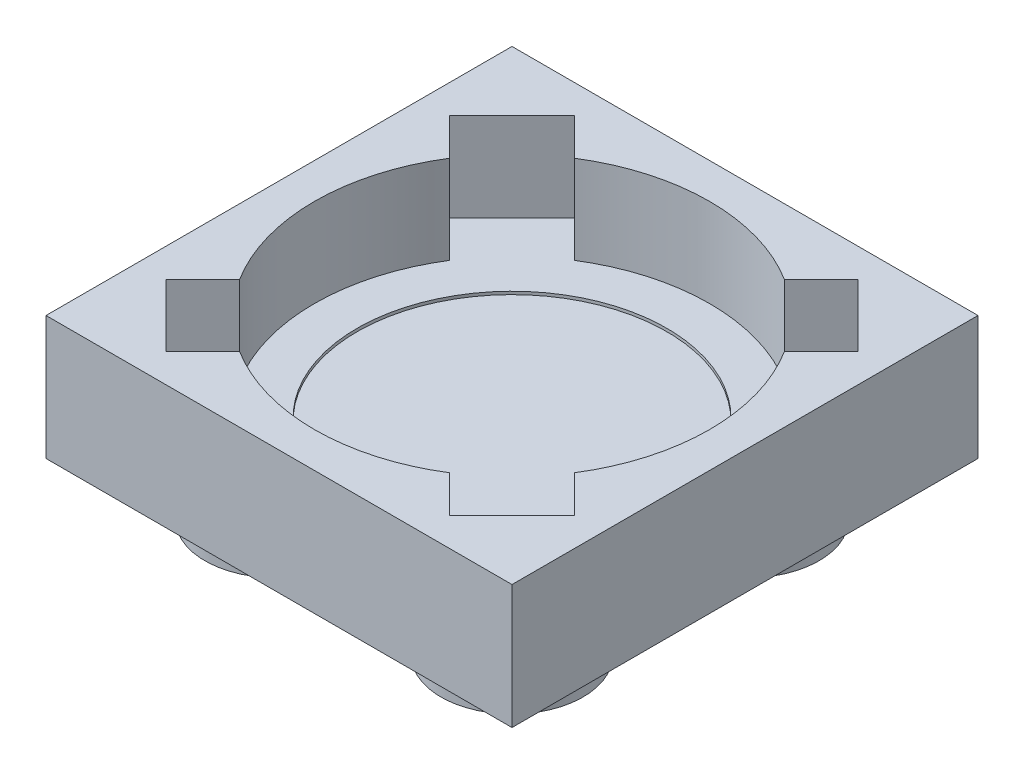
ISO-10303-21;
HEADER;
FILE_DESCRIPTION(('STEP AP214'),'2;1');
FILE_NAME('part.step','',(''),(''),'','','');
FILE_SCHEMA(('AUTOMOTIVE_DESIGN { 1 0 10303 214 1 1 1 1 }'));
ENDSEC;
DATA;
#1=APPLICATION_CONTEXT('core data for automotive mechanical design processes');
#2=APPLICATION_PROTOCOL_DEFINITION('international standard','automotive_design',2000,#1);
#3=PRODUCT_CONTEXT('',#1,'mechanical');
#4=PRODUCT('Part','Part','',(#3));
#5=PRODUCT_RELATED_PRODUCT_CATEGORY('part','',(#4));
#6=PRODUCT_DEFINITION_FORMATION('','',#4);
#7=PRODUCT_DEFINITION_CONTEXT('part definition',#1,'design');
#8=PRODUCT_DEFINITION('design','',#6,#7);
#9=PRODUCT_DEFINITION_SHAPE('','',#8);
#10=(LENGTH_UNIT() NAMED_UNIT(*) SI_UNIT(.MILLI.,.METRE.));
#11=(NAMED_UNIT(*) PLANE_ANGLE_UNIT() SI_UNIT($,.RADIAN.));
#12=(NAMED_UNIT(*) SI_UNIT($,.STERADIAN.) SOLID_ANGLE_UNIT());
#13=UNCERTAINTY_MEASURE_WITH_UNIT(LENGTH_MEASURE(1.E-05),#10,'distance_accuracy_value','');
#14=(GEOMETRIC_REPRESENTATION_CONTEXT(3) GLOBAL_UNCERTAINTY_ASSIGNED_CONTEXT((#13)) GLOBAL_UNIT_ASSIGNED_CONTEXT((#10,
#11,#12)) REPRESENTATION_CONTEXT('',''));
#15=CARTESIAN_POINT('',(0.,0.,0.));
#16=DIRECTION('',(0.,0.,1.));
#17=DIRECTION('',(1.,0.,0.));
#18=AXIS2_PLACEMENT_3D('',#15,#16,#17);
#19=CARTESIAN_POINT('',(7.9,9.47523086789974,-7.9));
#20=DIRECTION('',(0.,-1.,0.));
#21=DIRECTION('',(0.,0.,-1.));
#22=AXIS2_PLACEMENT_3D('',#19,#20,#21);
#23=CYLINDRICAL_SURFACE('',#22,6.7);
#24=CARTESIAN_POINT('',(7.9,-3.,-7.9));
#25=DIRECTION('',(0.,1.,0.));
#26=DIRECTION('',(0.,0.,1.));
#27=AXIS2_PLACEMENT_3D('',#24,#25,#26);
#28=CIRCLE('',#27,6.7);
#29=CARTESIAN_POINT('',(11.4566983804663,-3.,-13.5780187240259));
#30=VERTEX_POINT('',#29);
#31=CARTESIAN_POINT('',(4.34330161953374,-3.,-13.5780187240259));
#32=VERTEX_POINT('',#31);
#33=EDGE_CURVE('E277',#30,#32,#28,.T.);
#34=ORIENTED_EDGE('',*,*,#33,.F.);
#35=DIRECTION('',(0.,-1.,0.));
#36=VECTOR('',#35,1.);
#37=CARTESIAN_POINT('',(11.4566983804663,9.47523086789974,-13.5780187240259));
#38=LINE('',#37,#36);
#39=CARTESIAN_POINT('',(11.4566983804663,0.,-13.5780187240259));
#40=VERTEX_POINT('',#39);
#41=EDGE_CURVE('E81',#30,#40,#38,.F.);
#42=ORIENTED_EDGE('',*,*,#41,.T.);
#43=CARTESIAN_POINT('',(7.9,0.,-7.9));
#44=DIRECTION('',(0.,-1.,0.));
#45=DIRECTION('',(0.,0.,-1.));
#46=AXIS2_PLACEMENT_3D('',#43,#44,#45);
#47=CIRCLE('',#46,6.7);
#48=CARTESIAN_POINT('',(4.34330161953374,0.,-13.5780187240259));
#49=VERTEX_POINT('',#48);
#50=EDGE_CURVE('E296',#49,#40,#47,.T.);
#51=ORIENTED_EDGE('',*,*,#50,.F.);
#52=DIRECTION('',(0.,-1.,0.));
#53=VECTOR('',#52,1.);
#54=CARTESIAN_POINT('',(4.34330161953374,9.47523086789974,-13.5780187240259));
#55=LINE('',#54,#53);
#56=EDGE_CURVE('E370',#32,#49,#55,.F.);
#57=ORIENTED_EDGE('',*,*,#56,.F.);
#58=EDGE_LOOP('',(#34,#42,#51,#57));
#59=FACE_BOUND('',#58,.T.);
#60=ADVANCED_FACE('F73',(#59),#23,.F.);
#61=DIRECTION('',(0.,-1.,0.));
#62=VECTOR('',#61,1.);
#63=CARTESIAN_POINT('',(13.5780187240259,9.47523086789974,-11.4566983804662));
#64=LINE('',#63,#62);
#65=CARTESIAN_POINT('',(13.5780187240259,-3.,-11.4566983804662));
#66=VERTEX_POINT('',#65);
#67=CARTESIAN_POINT('',(13.5780187240259,0.,-11.4566983804662));
#68=VERTEX_POINT('',#67);
#69=EDGE_CURVE('E13',#66,#68,#64,.F.);
#70=ORIENTED_EDGE('',*,*,#69,.F.);
#71=CARTESIAN_POINT('',(13.5780187240259,-3.,-4.34330161953374));
#72=VERTEX_POINT('',#71);
#73=EDGE_CURVE('E216',#72,#66,#28,.T.);
#74=ORIENTED_EDGE('',*,*,#73,.F.);
#75=DIRECTION('',(0.,-1.,0.));
#76=VECTOR('',#75,1.);
#77=CARTESIAN_POINT('',(13.5780187240259,9.47523086789974,-4.34330161953374));
#78=LINE('',#77,#76);
#79=CARTESIAN_POINT('',(13.5780187240259,0.,-4.34330161953374));
#80=VERTEX_POINT('',#79);
#81=EDGE_CURVE('E376',#72,#80,#78,.F.);
#82=ORIENTED_EDGE('',*,*,#81,.T.);
#83=EDGE_CURVE('E300',#68,#80,#47,.T.);
#84=ORIENTED_EDGE('',*,*,#83,.F.);
#85=EDGE_LOOP('',(#70,#74,#82,#84));
#86=FACE_BOUND('',#85,.T.);
#87=ADVANCED_FACE('F422',(#86),#23,.F.);
#88=DIRECTION('',(0.,-1.,0.));
#89=VECTOR('',#88,1.);
#90=CARTESIAN_POINT('',(11.4566983804663,9.47523086789974,-2.2219812759741));
#91=LINE('',#90,#89);
#92=CARTESIAN_POINT('',(11.4566983804663,-3.,-2.2219812759741));
#93=VERTEX_POINT('',#92);
#94=CARTESIAN_POINT('',(11.4566983804663,0.,-2.2219812759741));
#95=VERTEX_POINT('',#94);
#96=EDGE_CURVE('E378',#93,#95,#91,.F.);
#97=ORIENTED_EDGE('',*,*,#96,.F.);
#98=CARTESIAN_POINT('',(4.34330161953369,-3.,-2.22198127597414));
#99=VERTEX_POINT('',#98);
#100=EDGE_CURVE('E305',#99,#93,#28,.T.);
#101=ORIENTED_EDGE('',*,*,#100,.F.);
#102=DIRECTION('',(0.,-1.,0.));
#103=VECTOR('',#102,1.);
#104=CARTESIAN_POINT('',(4.34330161953369,9.47523086789974,-2.22198127597414));
#105=LINE('',#104,#103);
#106=CARTESIAN_POINT('',(4.34330161953368,0.,-2.22198127597414));
#107=VERTEX_POINT('',#106);
#108=EDGE_CURVE('E372',#99,#107,#105,.F.);
#109=ORIENTED_EDGE('',*,*,#108,.T.);
#110=EDGE_CURVE('E411',#95,#107,#47,.T.);
#111=ORIENTED_EDGE('',*,*,#110,.F.);
#112=EDGE_LOOP('',(#97,#101,#109,#111));
#113=FACE_BOUND('',#112,.T.);
#114=ADVANCED_FACE('F408',(#113),#23,.F.);
#115=CARTESIAN_POINT('',(0.,-3.,0.));
#116=DIRECTION('',(0.,-1.,0.));
#117=DIRECTION('',(0.,0.,-1.));
#118=AXIS2_PLACEMENT_3D('',#115,#116,#117);
#119=PLANE('',#118);
#120=CARTESIAN_POINT('',(7.9,-3.,-7.9));
#121=DIRECTION('',(0.,1.,0.));
#122=DIRECTION('',(0.,0.,1.));
#123=AXIS2_PLACEMENT_3D('',#120,#121,#122);
#124=CIRCLE('',#123,5.25);
#125=CARTESIAN_POINT('',(7.9,-3.,-2.65));
#126=VERTEX_POINT('',#125);
#127=EDGE_CURVE('E299',#126,#126,#124,.T.);
#128=ORIENTED_EDGE('',*,*,#127,.F.);
#129=EDGE_LOOP('',(#128));
#130=FACE_BOUND('',#129,.T.);
#131=ORIENTED_EDGE('',*,*,#73,.T.);
#132=DIRECTION('',(0.70710678118655,0.,-0.707106781186545));
#133=VECTOR('',#132,1.);
#134=CARTESIAN_POINT('',(8.96066017177982,-3.,-6.83933982822018));
#135=LINE('',#134,#133);
#136=CARTESIAN_POINT('',(14.8296464556282,-3.,-12.7083261120685));
#137=VERTEX_POINT('',#136);
#138=EDGE_CURVE('E209',#66,#137,#135,.T.);
#139=ORIENTED_EDGE('',*,*,#138,.T.);
#140=DIRECTION('',(0.707106781186545,0.,0.70710678118655));
#141=VECTOR('',#140,1.);
#142=CARTESIAN_POINT('',(5.86898628384839,-3.,-21.6689862838484));
#143=LINE('',#142,#141);
#144=CARTESIAN_POINT('',(12.7083261120685,-3.,-14.8296464556281));
#145=VERTEX_POINT('',#144);
#146=EDGE_CURVE('E213',#145,#137,#143,.T.);
#147=ORIENTED_EDGE('',*,*,#146,.F.);
#148=DIRECTION('',(0.707106781186549,0.,-0.707106781186546));
#149=VECTOR('',#148,1.);
#150=CARTESIAN_POINT('',(6.8393398282202,-3.,-8.96066017177983));
#151=LINE('',#150,#149);
#152=EDGE_CURVE('E230',#30,#145,#151,.T.);
#153=ORIENTED_EDGE('',*,*,#152,.F.);
#154=ORIENTED_EDGE('',*,*,#33,.T.);
#155=DIRECTION('',(-0.707106781186548,0.,-0.707106781186547));
#156=VECTOR('',#155,1.);
#157=CARTESIAN_POINT('',(8.96066017177982,-3.,-8.96066017177983));
#158=LINE('',#157,#156);
#159=CARTESIAN_POINT('',(3.09167388793148,-3.,-14.8296464556282));
#160=VERTEX_POINT('',#159);
#161=EDGE_CURVE('E284',#32,#160,#158,.T.);
#162=ORIENTED_EDGE('',*,*,#161,.T.);
#163=DIRECTION('',(0.707106781186547,0.,-0.707106781186548));
#164=VECTOR('',#163,1.);
#165=CARTESIAN_POINT('',(-5.86898628384834,-3.,-5.86898628384834));
#166=LINE('',#165,#164);
#167=CARTESIAN_POINT('',(0.970353544371835,-3.,-12.7083261120685));
#168=VERTEX_POINT('',#167);
#169=EDGE_CURVE('E285',#168,#160,#166,.T.);
#170=ORIENTED_EDGE('',*,*,#169,.F.);
#171=DIRECTION('',(-0.707106781186549,0.,-0.707106781186546));
#172=VECTOR('',#171,1.);
#173=CARTESIAN_POINT('',(6.83933982822018,-3.,-6.8393398282202));
#174=LINE('',#173,#172);
#175=CARTESIAN_POINT('',(2.2219812759741,-3.,-11.4566983804663));
#176=VERTEX_POINT('',#175);
#177=EDGE_CURVE('E288',#176,#168,#174,.T.);
#178=ORIENTED_EDGE('',*,*,#177,.F.);
#179=CARTESIAN_POINT('',(2.22198127597406,-3.,-4.3433016195338));
#180=VERTEX_POINT('',#179);
#181=EDGE_CURVE('E302',#176,#180,#28,.T.);
#182=ORIENTED_EDGE('',*,*,#181,.T.);
#183=DIRECTION('',(-0.707106781186555,0.,0.70710678118654));
#184=VECTOR('',#183,1.);
#185=CARTESIAN_POINT('',(6.83933982822018,-3.,-8.96066017177983));
#186=LINE('',#185,#184);
#187=CARTESIAN_POINT('',(0.970353544371786,-3.,-3.09167388793155));
#188=VERTEX_POINT('',#187);
#189=EDGE_CURVE('E263',#180,#188,#186,.T.);
#190=ORIENTED_EDGE('',*,*,#189,.T.);
#191=DIRECTION('',(-0.70710678118654,0.,-0.707106781186555));
#192=VECTOR('',#191,1.);
#193=CARTESIAN_POINT('',(9.93101371615151,-3.,5.86898628384837));
#194=LINE('',#193,#192);
#195=CARTESIAN_POINT('',(3.0916738879314,-3.,-0.970353544371883));
#196=VERTEX_POINT('',#195);
#197=EDGE_CURVE('E264',#196,#188,#194,.T.);
#198=ORIENTED_EDGE('',*,*,#197,.F.);
#199=DIRECTION('',(-0.707106781186554,0.,0.707106781186541));
#200=VECTOR('',#199,1.);
#201=CARTESIAN_POINT('',(8.96066017177979,-3.,-6.83933982822017));
#202=LINE('',#201,#200);
#203=EDGE_CURVE('E267',#99,#196,#202,.T.);
#204=ORIENTED_EDGE('',*,*,#203,.F.);
#205=ORIENTED_EDGE('',*,*,#100,.T.);
#206=DIRECTION('',(0.707106781186548,0.,0.707106781186547));
#207=VECTOR('',#206,1.);
#208=CARTESIAN_POINT('',(6.83933982822018,-3.,-6.83933982822017));
#209=LINE('',#208,#207);
#210=CARTESIAN_POINT('',(12.7083261120685,-3.,-0.970353544371836));
#211=VERTEX_POINT('',#210);
#212=EDGE_CURVE('E245',#93,#211,#209,.T.);
#213=ORIENTED_EDGE('',*,*,#212,.T.);
#214=DIRECTION('',(-0.707106781186547,0.,0.707106781186548));
#215=VECTOR('',#214,1.);
#216=CARTESIAN_POINT('',(21.6689862838483,-3.,-9.93101371615166));
#217=LINE('',#216,#215);
#218=CARTESIAN_POINT('',(14.8296464556282,-3.,-3.09167388793148));
#219=VERTEX_POINT('',#218);
#220=EDGE_CURVE('E246',#219,#211,#217,.T.);
#221=ORIENTED_EDGE('',*,*,#220,.F.);
#222=DIRECTION('',(0.707106781186549,0.,0.707106781186546));
#223=VECTOR('',#222,1.);
#224=CARTESIAN_POINT('',(8.96066017177982,-3.,-8.9606601717798));
#225=LINE('',#224,#223);
#226=EDGE_CURVE('E249',#72,#219,#225,.T.);
#227=ORIENTED_EDGE('',*,*,#226,.F.);
#228=EDGE_LOOP('',(#131,#139,#147,#153,#154,#162,#170,#178,#182,#190,#198,#204,#205,#213,#221,#227));
#229=FACE_BOUND('',#228,.T.);
#230=ADVANCED_FACE('F211',(#130,#229),#119,.F.);
#231=CARTESIAN_POINT('',(3.9,-6.,-3.9));
#232=DIRECTION('',(0.,-1.,0.));
#233=DIRECTION('',(0.,0.,-1.));
#234=AXIS2_PLACEMENT_3D('',#231,#232,#233);
#235=PLANE('',#234);
#236=CARTESIAN_POINT('',(3.9,-6.,-3.9));
#237=DIRECTION('',(0.,-1.,0.));
#238=DIRECTION('',(0.,0.,-1.));
#239=AXIS2_PLACEMENT_3D('',#236,#237,#238);
#240=CIRCLE('',#239,2.41);
#241=CARTESIAN_POINT('',(3.9,-6.,-6.31));
#242=VERTEX_POINT('',#241);
#243=EDGE_CURVE('E364',#242,#242,#240,.T.);
#244=ORIENTED_EDGE('',*,*,#243,.T.);
#245=EDGE_LOOP('',(#244));
#246=FACE_BOUND('',#245,.T.);
#247=ADVANCED_FACE('F75',(#246),#235,.T.);
#248=CARTESIAN_POINT('',(3.9,-6.,-3.9));
#249=DIRECTION('',(0.,1.,0.));
#250=DIRECTION('',(0.,0.,1.));
#251=AXIS2_PLACEMENT_3D('',#248,#249,#250);
#252=CYLINDRICAL_SURFACE('',#251,2.41);
#253=ORIENTED_EDGE('',*,*,#243,.F.);
#254=EDGE_LOOP('',(#253));
#255=FACE_BOUND('',#254,.T.);
#256=CARTESIAN_POINT('',(3.9,-4.2,-3.9));
#257=DIRECTION('',(0.,-1.,0.));
#258=DIRECTION('',(0.,0.,-1.));
#259=AXIS2_PLACEMENT_3D('',#256,#257,#258);
#260=CIRCLE('',#259,2.41);
#261=CARTESIAN_POINT('',(3.9,-4.2,-6.31));
#262=VERTEX_POINT('',#261);
#263=EDGE_CURVE('E361',#262,#262,#260,.T.);
#264=ORIENTED_EDGE('',*,*,#263,.T.);
#265=EDGE_LOOP('',(#264));
#266=FACE_BOUND('',#265,.T.);
#267=ADVANCED_FACE('F462',(#255,#266),#252,.T.);
#268=CARTESIAN_POINT('',(3.9,-6.,-11.9));
#269=DIRECTION('',(0.,-1.,0.));
#270=DIRECTION('',(0.,0.,-1.));
#271=AXIS2_PLACEMENT_3D('',#268,#269,#270);
#272=PLANE('',#271);
#273=CARTESIAN_POINT('',(3.9,-6.,-11.9));
#274=DIRECTION('',(0.,-1.,0.));
#275=DIRECTION('',(0.,0.,-1.));
#276=AXIS2_PLACEMENT_3D('',#273,#274,#275);
#277=CIRCLE('',#276,2.41);
#278=CARTESIAN_POINT('',(3.9,-6.,-14.31));
#279=VERTEX_POINT('',#278);
#280=EDGE_CURVE('E358',#279,#279,#277,.T.);
#281=ORIENTED_EDGE('',*,*,#280,.T.);
#282=EDGE_LOOP('',(#281));
#283=FACE_BOUND('',#282,.T.);
#284=ADVANCED_FACE('F494',(#283),#272,.T.);
#285=CARTESIAN_POINT('',(3.9,-6.,-11.9));
#286=DIRECTION('',(0.,1.,0.));
#287=DIRECTION('',(0.,0.,1.));
#288=AXIS2_PLACEMENT_3D('',#285,#286,#287);
#289=CYLINDRICAL_SURFACE('',#288,2.41);
#290=ORIENTED_EDGE('',*,*,#280,.F.);
#291=EDGE_LOOP('',(#290));
#292=FACE_BOUND('',#291,.T.);
#293=CARTESIAN_POINT('',(3.9,-4.2,-11.9));
#294=DIRECTION('',(0.,-1.,0.));
#295=DIRECTION('',(0.,0.,-1.));
#296=AXIS2_PLACEMENT_3D('',#293,#294,#295);
#297=CIRCLE('',#296,2.41);
#298=CARTESIAN_POINT('',(3.9,-4.2,-14.31));
#299=VERTEX_POINT('',#298);
#300=EDGE_CURVE('E350',#299,#299,#297,.T.);
#301=ORIENTED_EDGE('',*,*,#300,.T.);
#302=EDGE_LOOP('',(#301));
#303=FACE_BOUND('',#302,.T.);
#304=ADVANCED_FACE('F490',(#292,#303),#289,.T.);
#305=CARTESIAN_POINT('',(0.,-4.2,0.));
#306=DIRECTION('',(-1.,0.,0.));
#307=DIRECTION('',(0.,0.,1.));
#308=AXIS2_PLACEMENT_3D('',#305,#306,#307);
#309=PLANE('',#308);
#310=DIRECTION('',(0.,0.,1.));
#311=VECTOR('',#310,1.);
#312=CARTESIAN_POINT('',(0.,0.,0.));
#313=LINE('',#312,#311);
#314=CARTESIAN_POINT('',(0.,0.,-15.8));
#315=VERTEX_POINT('',#314);
#316=CARTESIAN_POINT('',(0.,0.,0.));
#317=VERTEX_POINT('',#316);
#318=EDGE_CURVE('E321',#315,#317,#313,.T.);
#319=ORIENTED_EDGE('',*,*,#318,.F.);
#320=DIRECTION('',(0.,1.,0.));
#321=VECTOR('',#320,1.);
#322=CARTESIAN_POINT('',(0.,-4.2,-15.8));
#323=LINE('',#322,#321);
#324=CARTESIAN_POINT('',(0.,-4.2,-15.8));
#325=VERTEX_POINT('',#324);
#326=EDGE_CURVE('E348',#325,#315,#323,.T.);
#327=ORIENTED_EDGE('',*,*,#326,.F.);
#328=DIRECTION('',(0.,0.,1.));
#329=VECTOR('',#328,1.);
#330=CARTESIAN_POINT('',(0.,-4.2,0.));
#331=LINE('',#330,#329);
#332=CARTESIAN_POINT('',(0.,-4.2,0.));
#333=VERTEX_POINT('',#332);
#334=EDGE_CURVE('E324',#325,#333,#331,.T.);
#335=ORIENTED_EDGE('',*,*,#334,.T.);
#336=DIRECTION('',(0.,1.,0.));
#337=VECTOR('',#336,1.);
#338=CARTESIAN_POINT('',(0.,-4.2,0.));
#339=LINE('',#338,#337);
#340=EDGE_CURVE('E337',#333,#317,#339,.T.);
#341=ORIENTED_EDGE('',*,*,#340,.T.);
#342=EDGE_LOOP('',(#319,#327,#335,#341));
#343=FACE_BOUND('',#342,.T.);
#344=ADVANCED_FACE('F480',(#343),#309,.T.);
#345=CARTESIAN_POINT('',(0.,-4.2,-15.8));
#346=DIRECTION('',(0.,0.,-1.));
#347=DIRECTION('',(-1.,0.,0.));
#348=AXIS2_PLACEMENT_3D('',#345,#346,#347);
#349=PLANE('',#348);
#350=DIRECTION('',(-1.,0.,0.));
#351=VECTOR('',#350,1.);
#352=CARTESIAN_POINT('',(0.,0.,-15.8));
#353=LINE('',#352,#351);
#354=CARTESIAN_POINT('',(15.8,0.,-15.8));
#355=VERTEX_POINT('',#354);
#356=EDGE_CURVE('E328',#355,#315,#353,.T.);
#357=ORIENTED_EDGE('',*,*,#356,.F.);
#358=DIRECTION('',(0.,1.,0.));
#359=VECTOR('',#358,1.);
#360=CARTESIAN_POINT('',(15.8,-4.2,-15.8));
#361=LINE('',#360,#359);
#362=CARTESIAN_POINT('',(15.8,-4.2,-15.8));
#363=VERTEX_POINT('',#362);
#364=EDGE_CURVE('E351',#363,#355,#361,.T.);
#365=ORIENTED_EDGE('',*,*,#364,.F.);
#366=DIRECTION('',(-1.,0.,0.));
#367=VECTOR('',#366,1.);
#368=CARTESIAN_POINT('',(0.,-4.2,-15.8));
#369=LINE('',#368,#367);
#370=EDGE_CURVE('E334',#363,#325,#369,.T.);
#371=ORIENTED_EDGE('',*,*,#370,.T.);
#372=ORIENTED_EDGE('',*,*,#326,.T.);
#373=EDGE_LOOP('',(#357,#365,#371,#372));
#374=FACE_BOUND('',#373,.T.);
#375=ADVANCED_FACE('F476',(#374),#349,.T.);
#376=CARTESIAN_POINT('',(15.8,-4.2,0.));
#377=DIRECTION('',(1.,0.,0.));
#378=DIRECTION('',(0.,0.,-1.));
#379=AXIS2_PLACEMENT_3D('',#376,#377,#378);
#380=PLANE('',#379);
#381=DIRECTION('',(0.,0.,-1.));
#382=VECTOR('',#381,1.);
#383=CARTESIAN_POINT('',(15.8,0.,0.));
#384=LINE('',#383,#382);
#385=CARTESIAN_POINT('',(15.8,0.,0.));
#386=VERTEX_POINT('',#385);
#387=EDGE_CURVE('E343',#386,#355,#384,.T.);
#388=ORIENTED_EDGE('',*,*,#387,.F.);
#389=DIRECTION('',(0.,1.,0.));
#390=VECTOR('',#389,1.);
#391=CARTESIAN_POINT('',(15.8,-4.2,0.));
#392=LINE('',#391,#390);
#393=CARTESIAN_POINT('',(15.8,-4.2,0.));
#394=VERTEX_POINT('',#393);
#395=EDGE_CURVE('E353',#394,#386,#392,.T.);
#396=ORIENTED_EDGE('',*,*,#395,.F.);
#397=DIRECTION('',(0.,0.,-1.));
#398=VECTOR('',#397,1.);
#399=CARTESIAN_POINT('',(15.8,-4.2,0.));
#400=LINE('',#399,#398);
#401=EDGE_CURVE('E331',#394,#363,#400,.T.);
#402=ORIENTED_EDGE('',*,*,#401,.T.);
#403=ORIENTED_EDGE('',*,*,#364,.T.);
#404=EDGE_LOOP('',(#388,#396,#402,#403));
#405=FACE_BOUND('',#404,.T.);
#406=ADVANCED_FACE('F479',(#405),#380,.T.);
#407=CARTESIAN_POINT('',(0.,-4.2,0.));
#408=DIRECTION('',(0.,0.,1.));
#409=DIRECTION('',(1.,0.,0.));
#410=AXIS2_PLACEMENT_3D('',#407,#408,#409);
#411=PLANE('',#410);
#412=DIRECTION('',(1.,0.,0.));
#413=VECTOR('',#412,1.);
#414=CARTESIAN_POINT('',(0.,0.,0.));
#415=LINE('',#414,#413);
#416=EDGE_CURVE('E340',#317,#386,#415,.T.);
#417=ORIENTED_EDGE('',*,*,#416,.F.);
#418=ORIENTED_EDGE('',*,*,#340,.F.);
#419=DIRECTION('',(1.,0.,0.));
#420=VECTOR('',#419,1.);
#421=CARTESIAN_POINT('',(0.,-4.2,0.));
#422=LINE('',#421,#420);
#423=EDGE_CURVE('E327',#333,#394,#422,.T.);
#424=ORIENTED_EDGE('',*,*,#423,.T.);
#425=ORIENTED_EDGE('',*,*,#395,.T.);
#426=EDGE_LOOP('',(#417,#418,#424,#425));
#427=FACE_BOUND('',#426,.T.);
#428=ADVANCED_FACE('F472',(#427),#411,.T.);
#429=CARTESIAN_POINT('',(0.,-4.2,0.));
#430=DIRECTION('',(0.,-1.,0.));
#431=DIRECTION('',(0.,0.,-1.));
#432=AXIS2_PLACEMENT_3D('',#429,#430,#431);
#433=PLANE('',#432);
#434=CARTESIAN_POINT('',(11.9,-4.2,-3.9));
#435=DIRECTION('',(0.,-1.,0.));
#436=DIRECTION('',(0.,0.,-1.));
#437=AXIS2_PLACEMENT_3D('',#434,#435,#436);
#438=CIRCLE('',#437,2.41);
#439=CARTESIAN_POINT('',(11.9,-4.2,-6.31));
#440=VERTEX_POINT('',#439);
#441=EDGE_CURVE('E309',#440,#440,#438,.T.);
#442=ORIENTED_EDGE('',*,*,#441,.F.);
#443=EDGE_LOOP('',(#442));
#444=FACE_BOUND('',#443,.T.);
#445=CARTESIAN_POINT('',(11.9,-4.2,-11.9));
#446=DIRECTION('',(0.,-1.,0.));
#447=DIRECTION('',(0.,0.,-1.));
#448=AXIS2_PLACEMENT_3D('',#445,#446,#447);
#449=CIRCLE('',#448,2.41);
#450=CARTESIAN_POINT('',(11.9,-4.2,-14.31));
#451=VERTEX_POINT('',#450);
#452=EDGE_CURVE('E317',#451,#451,#449,.T.);
#453=ORIENTED_EDGE('',*,*,#452,.F.);
#454=EDGE_LOOP('',(#453));
#455=FACE_BOUND('',#454,.T.);
#456=ORIENTED_EDGE('',*,*,#334,.F.);
#457=ORIENTED_EDGE('',*,*,#370,.F.);
#458=ORIENTED_EDGE('',*,*,#401,.F.);
#459=ORIENTED_EDGE('',*,*,#423,.F.);
#460=EDGE_LOOP('',(#456,#457,#458,#459));
#461=FACE_BOUND('',#460,.T.);
#462=ORIENTED_EDGE('',*,*,#300,.F.);
#463=EDGE_LOOP('',(#462));
#464=FACE_BOUND('',#463,.T.);
#465=ORIENTED_EDGE('',*,*,#263,.F.);
#466=EDGE_LOOP('',(#465));
#467=FACE_BOUND('',#466,.T.);
#468=ADVANCED_FACE('F469',(#444,#455,#461,#464,#467),#433,.T.);
#469=CARTESIAN_POINT('',(0.,0.,0.));
#470=DIRECTION('',(0.,-1.,0.));
#471=DIRECTION('',(0.,0.,-1.));
#472=AXIS2_PLACEMENT_3D('',#469,#470,#471);
#473=PLANE('',#472);
#474=DIRECTION('',(0.707106781186545,0.,0.70710678118655));
#475=VECTOR('',#474,1.);
#476=CARTESIAN_POINT('',(5.86898628384839,0.,-21.6689862838484));
#477=LINE('',#476,#475);
#478=CARTESIAN_POINT('',(12.7083261120685,0.,-14.8296464556282));
#479=VERTEX_POINT('',#478);
#480=CARTESIAN_POINT('',(14.8296464556282,0.,-12.7083261120685));
#481=VERTEX_POINT('',#480);
#482=EDGE_CURVE('E235',#479,#481,#477,.T.);
#483=ORIENTED_EDGE('',*,*,#482,.T.);
#484=DIRECTION('',(0.70710678118655,0.,-0.707106781186545));
#485=VECTOR('',#484,1.);
#486=CARTESIAN_POINT('',(8.96066017177982,0.,-6.83933982822018));
#487=LINE('',#486,#485);
#488=EDGE_CURVE('E221',#68,#481,#487,.T.);
#489=ORIENTED_EDGE('',*,*,#488,.F.);
#490=ORIENTED_EDGE('',*,*,#83,.T.);
#491=DIRECTION('',(0.707106781186549,0.,0.707106781186546));
#492=VECTOR('',#491,1.);
#493=CARTESIAN_POINT('',(8.96066017177982,0.,-8.9606601717798));
#494=LINE('',#493,#492);
#495=CARTESIAN_POINT('',(14.8296464556282,0.,-3.09167388793148));
#496=VERTEX_POINT('',#495);
#497=EDGE_CURVE('E96',#80,#496,#494,.T.);
#498=ORIENTED_EDGE('',*,*,#497,.T.);
#499=DIRECTION('',(-0.707106781186547,0.,0.707106781186548));
#500=VECTOR('',#499,1.);
#501=CARTESIAN_POINT('',(21.6689862838483,0.,-9.93101371615166));
#502=LINE('',#501,#500);
#503=CARTESIAN_POINT('',(12.7083261120685,0.,-0.970353544371836));
#504=VERTEX_POINT('',#503);
#505=EDGE_CURVE('E239',#496,#504,#502,.T.);
#506=ORIENTED_EDGE('',*,*,#505,.T.);
#507=DIRECTION('',(0.707106781186548,0.,0.707106781186547));
#508=VECTOR('',#507,1.);
#509=CARTESIAN_POINT('',(6.83933982822018,0.,-6.83933982822017));
#510=LINE('',#509,#508);
#511=EDGE_CURVE('E243',#95,#504,#510,.T.);
#512=ORIENTED_EDGE('',*,*,#511,.F.);
#513=ORIENTED_EDGE('',*,*,#110,.T.);
#514=DIRECTION('',(-0.707106781186554,0.,0.707106781186541));
#515=VECTOR('',#514,1.);
#516=CARTESIAN_POINT('',(8.96066017177979,0.,-6.83933982822017));
#517=LINE('',#516,#515);
#518=CARTESIAN_POINT('',(3.0916738879314,0.,-0.970353544371882));
#519=VERTEX_POINT('',#518);
#520=EDGE_CURVE('E88',#107,#519,#517,.T.);
#521=ORIENTED_EDGE('',*,*,#520,.T.);
#522=DIRECTION('',(-0.70710678118654,0.,-0.707106781186555));
#523=VECTOR('',#522,1.);
#524=CARTESIAN_POINT('',(9.93101371615151,0.,5.86898628384837));
#525=LINE('',#524,#523);
#526=CARTESIAN_POINT('',(0.970353544371786,0.,-3.09167388793155));
#527=VERTEX_POINT('',#526);
#528=EDGE_CURVE('E257',#519,#527,#525,.T.);
#529=ORIENTED_EDGE('',*,*,#528,.T.);
#530=DIRECTION('',(-0.707106781186555,0.,0.70710678118654));
#531=VECTOR('',#530,1.);
#532=CARTESIAN_POINT('',(6.83933982822018,0.,-8.96066017177983));
#533=LINE('',#532,#531);
#534=CARTESIAN_POINT('',(2.22198127597407,0.,-4.3433016195338));
#535=VERTEX_POINT('',#534);
#536=EDGE_CURVE('E261',#535,#527,#533,.T.);
#537=ORIENTED_EDGE('',*,*,#536,.F.);
#538=CARTESIAN_POINT('',(2.2219812759741,0.,-11.4566983804663));
#539=VERTEX_POINT('',#538);
#540=EDGE_CURVE('E301',#535,#539,#47,.T.);
#541=ORIENTED_EDGE('',*,*,#540,.T.);
#542=DIRECTION('',(-0.707106781186549,0.,-0.707106781186546));
#543=VECTOR('',#542,1.);
#544=CARTESIAN_POINT('',(6.83933982822018,0.,-6.8393398282202));
#545=LINE('',#544,#543);
#546=CARTESIAN_POINT('',(0.970353544371833,0.,-12.7083261120685));
#547=VERTEX_POINT('',#546);
#548=EDGE_CURVE('E274',#539,#547,#545,.T.);
#549=ORIENTED_EDGE('',*,*,#548,.T.);
#550=DIRECTION('',(0.707106781186547,0.,-0.707106781186548));
#551=VECTOR('',#550,1.);
#552=CARTESIAN_POINT('',(-5.86898628384834,0.,-5.86898628384834));
#553=LINE('',#552,#551);
#554=CARTESIAN_POINT('',(3.09167388793148,0.,-14.8296464556282));
#555=VERTEX_POINT('',#554);
#556=EDGE_CURVE('E278',#547,#555,#553,.T.);
#557=ORIENTED_EDGE('',*,*,#556,.T.);
#558=DIRECTION('',(-0.707106781186548,0.,-0.707106781186547));
#559=VECTOR('',#558,1.);
#560=CARTESIAN_POINT('',(8.96066017177982,0.,-8.96066017177983));
#561=LINE('',#560,#559);
#562=EDGE_CURVE('E282',#49,#555,#561,.T.);
#563=ORIENTED_EDGE('',*,*,#562,.F.);
#564=ORIENTED_EDGE('',*,*,#50,.T.);
#565=DIRECTION('',(0.707106781186549,0.,-0.707106781186546));
#566=VECTOR('',#565,1.);
#567=CARTESIAN_POINT('',(6.8393398282202,0.,-8.96066017177983));
#568=LINE('',#567,#566);
#569=EDGE_CURVE('E290',#40,#479,#568,.T.);
#570=ORIENTED_EDGE('',*,*,#569,.T.);
#571=EDGE_LOOP('',(#483,#489,#490,#498,#506,#512,#513,#521,#529,#537,#541,#549,#557,#563,#564,#570));
#572=FACE_BOUND('',#571,.T.);
#573=ORIENTED_EDGE('',*,*,#318,.T.);
#574=ORIENTED_EDGE('',*,*,#416,.T.);
#575=ORIENTED_EDGE('',*,*,#387,.T.);
#576=ORIENTED_EDGE('',*,*,#356,.T.);
#577=EDGE_LOOP('',(#573,#574,#575,#576));
#578=FACE_BOUND('',#577,.T.);
#579=ADVANCED_FACE('F388',(#572,#578),#473,.F.);
#580=CARTESIAN_POINT('',(11.9,-6.,-11.9));
#581=DIRECTION('',(0.,1.,0.));
#582=DIRECTION('',(0.,0.,1.));
#583=AXIS2_PLACEMENT_3D('',#580,#581,#582);
#584=CYLINDRICAL_SURFACE('',#583,2.41);
#585=CARTESIAN_POINT('',(11.9,-6.,-11.9));
#586=DIRECTION('',(0.,-1.,0.));
#587=DIRECTION('',(0.,0.,-1.));
#588=AXIS2_PLACEMENT_3D('',#585,#586,#587);
#589=CIRCLE('',#588,2.41);
#590=CARTESIAN_POINT('',(11.9,-6.,-14.31));
#591=VERTEX_POINT('',#590);
#592=EDGE_CURVE('E318',#591,#591,#589,.T.);
#593=ORIENTED_EDGE('',*,*,#592,.F.);
#594=EDGE_LOOP('',(#593));
#595=FACE_BOUND('',#594,.T.);
#596=ORIENTED_EDGE('',*,*,#452,.T.);
#597=EDGE_LOOP('',(#596));
#598=FACE_BOUND('',#597,.T.);
#599=ADVANCED_FACE('F467',(#595,#598),#584,.T.);
#600=CARTESIAN_POINT('',(11.9,-6.,-11.9));
#601=DIRECTION('',(0.,-1.,0.));
#602=DIRECTION('',(0.,0.,-1.));
#603=AXIS2_PLACEMENT_3D('',#600,#601,#602);
#604=PLANE('',#603);
#605=ORIENTED_EDGE('',*,*,#592,.T.);
#606=EDGE_LOOP('',(#605));
#607=FACE_BOUND('',#606,.T.);
#608=ADVANCED_FACE('F547',(#607),#604,.T.);
#609=CARTESIAN_POINT('',(11.9,-6.,-3.9));
#610=DIRECTION('',(0.,1.,0.));
#611=DIRECTION('',(0.,0.,1.));
#612=AXIS2_PLACEMENT_3D('',#609,#610,#611);
#613=CYLINDRICAL_SURFACE('',#612,2.41);
#614=CARTESIAN_POINT('',(11.9,-6.,-3.9));
#615=DIRECTION('',(0.,-1.,0.));
#616=DIRECTION('',(0.,0.,-1.));
#617=AXIS2_PLACEMENT_3D('',#614,#615,#616);
#618=CIRCLE('',#617,2.41);
#619=CARTESIAN_POINT('',(11.9,-6.,-6.31));
#620=VERTEX_POINT('',#619);
#621=EDGE_CURVE('E314',#620,#620,#618,.T.);
#622=ORIENTED_EDGE('',*,*,#621,.F.);
#623=EDGE_LOOP('',(#622));
#624=FACE_BOUND('',#623,.T.);
#625=ORIENTED_EDGE('',*,*,#441,.T.);
#626=EDGE_LOOP('',(#625));
#627=FACE_BOUND('',#626,.T.);
#628=ADVANCED_FACE('F554',(#624,#627),#613,.T.);
#629=CARTESIAN_POINT('',(11.9,-6.,-3.9));
#630=DIRECTION('',(0.,-1.,0.));
#631=DIRECTION('',(0.,0.,-1.));
#632=AXIS2_PLACEMENT_3D('',#629,#630,#631);
#633=PLANE('',#632);
#634=ORIENTED_EDGE('',*,*,#621,.T.);
#635=EDGE_LOOP('',(#634));
#636=FACE_BOUND('',#635,.T.);
#637=ADVANCED_FACE('F560',(#636),#633,.T.);
#638=CARTESIAN_POINT('',(7.9,-3.1,-7.9));
#639=DIRECTION('',(0.,1.,0.));
#640=DIRECTION('',(0.,0.,1.));
#641=AXIS2_PLACEMENT_3D('',#638,#639,#640);
#642=CYLINDRICAL_SURFACE('',#641,5.25);
#643=CARTESIAN_POINT('',(7.9,-3.1,-7.9));
#644=DIRECTION('',(0.,1.,0.));
#645=DIRECTION('',(0.,0.,1.));
#646=AXIS2_PLACEMENT_3D('',#643,#644,#645);
#647=CIRCLE('',#646,5.25);
#648=CARTESIAN_POINT('',(7.9,-3.1,-2.65));
#649=VERTEX_POINT('',#648);
#650=EDGE_CURVE('E306',#649,#649,#647,.T.);
#651=ORIENTED_EDGE('',*,*,#650,.F.);
#652=EDGE_LOOP('',(#651));
#653=FACE_BOUND('',#652,.T.);
#654=ORIENTED_EDGE('',*,*,#127,.T.);
#655=EDGE_LOOP('',(#654));
#656=FACE_BOUND('',#655,.T.);
#657=ADVANCED_FACE('F450',(#653,#656),#642,.F.);
#658=CARTESIAN_POINT('',(7.9,-3.1,-7.9));
#659=DIRECTION('',(0.,1.,0.));
#660=DIRECTION('',(0.,0.,1.));
#661=AXIS2_PLACEMENT_3D('',#658,#659,#660);
#662=PLANE('',#661);
#663=ORIENTED_EDGE('',*,*,#650,.T.);
#664=EDGE_LOOP('',(#663));
#665=FACE_BOUND('',#664,.T.);
#666=ADVANCED_FACE('F444',(#665),#662,.T.);
#667=DIRECTION('',(0.,-1.,0.));
#668=VECTOR('',#667,1.);
#669=CARTESIAN_POINT('',(2.22198127597407,9.47523086789974,-4.3433016195338));
#670=LINE('',#669,#668);
#671=EDGE_CURVE('E374',#180,#535,#670,.F.);
#672=ORIENTED_EDGE('',*,*,#671,.F.);
#673=ORIENTED_EDGE('',*,*,#181,.F.);
#674=DIRECTION('',(0.,-1.,0.));
#675=VECTOR('',#674,1.);
#676=CARTESIAN_POINT('',(2.2219812759741,9.47523086789974,-11.4566983804663));
#677=LINE('',#676,#675);
#678=EDGE_CURVE('E367',#176,#539,#677,.F.);
#679=ORIENTED_EDGE('',*,*,#678,.T.);
#680=ORIENTED_EDGE('',*,*,#540,.F.);
#681=EDGE_LOOP('',(#672,#673,#679,#680));
#682=FACE_BOUND('',#681,.T.);
#683=ADVANCED_FACE('F437',(#682),#23,.F.);
#684=CARTESIAN_POINT('',(8.96066017177982,-9.25517446877458,-8.96066017177983));
#685=DIRECTION('',(0.707106781186547,0.,-0.707106781186548));
#686=DIRECTION('',(-0.707106781186548,0.,-0.707106781186547));
#687=AXIS2_PLACEMENT_3D('',#684,#685,#686);
#688=PLANE('',#687);
#689=ORIENTED_EDGE('',*,*,#56,.T.);
#690=ORIENTED_EDGE('',*,*,#562,.T.);
#691=DIRECTION('',(0.,1.,0.));
#692=VECTOR('',#691,1.);
#693=CARTESIAN_POINT('',(3.09167388793148,-9.25517446877458,-14.8296464556282));
#694=LINE('',#693,#692);
#695=EDGE_CURVE('E287',#160,#555,#694,.T.);
#696=ORIENTED_EDGE('',*,*,#695,.F.);
#697=ORIENTED_EDGE('',*,*,#161,.F.);
#698=EDGE_LOOP('',(#689,#690,#696,#697));
#699=FACE_BOUND('',#698,.T.);
#700=ADVANCED_FACE('F393',(#699),#688,.F.);
#701=CARTESIAN_POINT('',(-5.86898628384834,-9.25517446877458,-5.86898628384834));
#702=DIRECTION('',(0.707106781186548,0.,0.707106781186547));
#703=DIRECTION('',(0.707106781186547,0.,-0.707106781186548));
#704=AXIS2_PLACEMENT_3D('',#701,#702,#703);
#705=PLANE('',#704);
#706=ORIENTED_EDGE('',*,*,#169,.T.);
#707=ORIENTED_EDGE('',*,*,#695,.T.);
#708=ORIENTED_EDGE('',*,*,#556,.F.);
#709=DIRECTION('',(0.,1.,0.));
#710=VECTOR('',#709,1.);
#711=CARTESIAN_POINT('',(0.970353544371833,-9.25517446877458,-12.7083261120685));
#712=LINE('',#711,#710);
#713=EDGE_CURVE('E281',#168,#547,#712,.T.);
#714=ORIENTED_EDGE('',*,*,#713,.F.);
#715=EDGE_LOOP('',(#706,#707,#708,#714));
#716=FACE_BOUND('',#715,.T.);
#717=ADVANCED_FACE('F396',(#716),#705,.T.);
#718=CARTESIAN_POINT('',(6.83933982822018,-9.25517446877458,-6.8393398282202));
#719=DIRECTION('',(0.707106781186546,0.,-0.707106781186549));
#720=DIRECTION('',(-0.707106781186549,0.,-0.707106781186546));
#721=AXIS2_PLACEMENT_3D('',#718,#719,#720);
#722=PLANE('',#721);
#723=ORIENTED_EDGE('',*,*,#177,.T.);
#724=ORIENTED_EDGE('',*,*,#713,.T.);
#725=ORIENTED_EDGE('',*,*,#548,.F.);
#726=ORIENTED_EDGE('',*,*,#678,.F.);
#727=EDGE_LOOP('',(#723,#724,#725,#726));
#728=FACE_BOUND('',#727,.T.);
#729=ADVANCED_FACE('F597',(#728),#722,.T.);
#730=CARTESIAN_POINT('',(6.83933982822018,-9.25517446877458,-8.96066017177983));
#731=DIRECTION('',(-0.70710678118654,0.,-0.707106781186555));
#732=DIRECTION('',(-0.707106781186555,0.,0.70710678118654));
#733=AXIS2_PLACEMENT_3D('',#730,#731,#732);
#734=PLANE('',#733);
#735=ORIENTED_EDGE('',*,*,#671,.T.);
#736=ORIENTED_EDGE('',*,*,#536,.T.);
#737=DIRECTION('',(0.,1.,0.));
#738=VECTOR('',#737,1.);
#739=CARTESIAN_POINT('',(0.970353544371786,-9.25517446877458,-3.09167388793155));
#740=LINE('',#739,#738);
#741=EDGE_CURVE('E266',#188,#527,#740,.T.);
#742=ORIENTED_EDGE('',*,*,#741,.F.);
#743=ORIENTED_EDGE('',*,*,#189,.F.);
#744=EDGE_LOOP('',(#735,#736,#742,#743));
#745=FACE_BOUND('',#744,.T.);
#746=ADVANCED_FACE('F606',(#745),#734,.F.);
#747=CARTESIAN_POINT('',(9.93101371615151,-9.25517446877458,5.86898628384837));
#748=DIRECTION('',(0.707106781186555,0.,-0.70710678118654));
#749=DIRECTION('',(-0.70710678118654,0.,-0.707106781186555));
#750=AXIS2_PLACEMENT_3D('',#747,#748,#749);
#751=PLANE('',#750);
#752=ORIENTED_EDGE('',*,*,#197,.T.);
#753=ORIENTED_EDGE('',*,*,#741,.T.);
#754=ORIENTED_EDGE('',*,*,#528,.F.);
#755=DIRECTION('',(0.,1.,0.));
#756=VECTOR('',#755,1.);
#757=CARTESIAN_POINT('',(3.0916738879314,-9.25517446877458,-0.970353544371882));
#758=LINE('',#757,#756);
#759=EDGE_CURVE('E260',#196,#519,#758,.T.);
#760=ORIENTED_EDGE('',*,*,#759,.F.);
#761=EDGE_LOOP('',(#752,#753,#754,#760));
#762=FACE_BOUND('',#761,.T.);
#763=ADVANCED_FACE('F645',(#762),#751,.T.);
#764=CARTESIAN_POINT('',(8.96066017177979,-9.25517446877458,-6.83933982822017));
#765=DIRECTION('',(-0.707106781186541,0.,-0.707106781186554));
#766=DIRECTION('',(-0.707106781186554,0.,0.707106781186541));
#767=AXIS2_PLACEMENT_3D('',#764,#765,#766);
#768=PLANE('',#767);
#769=ORIENTED_EDGE('',*,*,#203,.T.);
#770=ORIENTED_EDGE('',*,*,#759,.T.);
#771=ORIENTED_EDGE('',*,*,#520,.F.);
#772=ORIENTED_EDGE('',*,*,#108,.F.);
#773=EDGE_LOOP('',(#769,#770,#771,#772));
#774=FACE_BOUND('',#773,.T.);
#775=ADVANCED_FACE('F658',(#774),#768,.T.);
#776=CARTESIAN_POINT('',(6.83933982822018,-9.25517446877458,-6.83933982822017));
#777=DIRECTION('',(-0.707106781186547,0.,0.707106781186548));
#778=DIRECTION('',(0.707106781186548,0.,0.707106781186547));
#779=AXIS2_PLACEMENT_3D('',#776,#777,#778);
#780=PLANE('',#779);
#781=ORIENTED_EDGE('',*,*,#96,.T.);
#782=ORIENTED_EDGE('',*,*,#511,.T.);
#783=DIRECTION('',(0.,1.,0.));
#784=VECTOR('',#783,1.);
#785=CARTESIAN_POINT('',(12.7083261120685,-9.25517446877458,-0.970353544371836));
#786=LINE('',#785,#784);
#787=EDGE_CURVE('E248',#211,#504,#786,.T.);
#788=ORIENTED_EDGE('',*,*,#787,.F.);
#789=ORIENTED_EDGE('',*,*,#212,.F.);
#790=EDGE_LOOP('',(#781,#782,#788,#789));
#791=FACE_BOUND('',#790,.T.);
#792=ADVANCED_FACE('F414',(#791),#780,.F.);
#793=CARTESIAN_POINT('',(21.6689862838483,-9.25517446877458,-9.93101371615166));
#794=DIRECTION('',(-0.707106781186548,0.,-0.707106781186547));
#795=DIRECTION('',(-0.707106781186547,0.,0.707106781186548));
#796=AXIS2_PLACEMENT_3D('',#793,#794,#795);
#797=PLANE('',#796);
#798=ORIENTED_EDGE('',*,*,#220,.T.);
#799=ORIENTED_EDGE('',*,*,#787,.T.);
#800=ORIENTED_EDGE('',*,*,#505,.F.);
#801=DIRECTION('',(0.,1.,0.));
#802=VECTOR('',#801,1.);
#803=CARTESIAN_POINT('',(14.8296464556282,-9.25517446877458,-3.09167388793148));
#804=LINE('',#803,#802);
#805=EDGE_CURVE('E242',#219,#496,#804,.T.);
#806=ORIENTED_EDGE('',*,*,#805,.F.);
#807=EDGE_LOOP('',(#798,#799,#800,#806));
#808=FACE_BOUND('',#807,.T.);
#809=ADVANCED_FACE('F420',(#808),#797,.T.);
#810=CARTESIAN_POINT('',(8.96066017177982,-9.25517446877458,-8.9606601717798));
#811=DIRECTION('',(-0.707106781186546,0.,0.707106781186549));
#812=DIRECTION('',(0.707106781186549,0.,0.707106781186546));
#813=AXIS2_PLACEMENT_3D('',#810,#811,#812);
#814=PLANE('',#813);
#815=ORIENTED_EDGE('',*,*,#226,.T.);
#816=ORIENTED_EDGE('',*,*,#805,.T.);
#817=ORIENTED_EDGE('',*,*,#497,.F.);
#818=ORIENTED_EDGE('',*,*,#81,.F.);
#819=EDGE_LOOP('',(#815,#816,#817,#818));
#820=FACE_BOUND('',#819,.T.);
#821=ADVANCED_FACE('F687',(#820),#814,.T.);
#822=CARTESIAN_POINT('',(8.96066017177982,-9.25517446877458,-6.83933982822018));
#823=DIRECTION('',(0.707106781186545,0.,0.70710678118655));
#824=DIRECTION('',(0.70710678118655,0.,-0.707106781186545));
#825=AXIS2_PLACEMENT_3D('',#822,#823,#824);
#826=PLANE('',#825);
#827=ORIENTED_EDGE('',*,*,#69,.T.);
#828=ORIENTED_EDGE('',*,*,#488,.T.);
#829=DIRECTION('',(0.,1.,0.));
#830=VECTOR('',#829,1.);
#831=CARTESIAN_POINT('',(14.8296464556282,-9.25517446877458,-12.7083261120685));
#832=LINE('',#831,#830);
#833=EDGE_CURVE('E220',#137,#481,#832,.T.);
#834=ORIENTED_EDGE('',*,*,#833,.F.);
#835=ORIENTED_EDGE('',*,*,#138,.F.);
#836=EDGE_LOOP('',(#827,#828,#834,#835));
#837=FACE_BOUND('',#836,.T.);
#838=ADVANCED_FACE('F232',(#837),#826,.F.);
#839=CARTESIAN_POINT('',(5.86898628384839,-9.25517446877458,-21.6689862838484));
#840=DIRECTION('',(-0.70710678118655,0.,0.707106781186545));
#841=DIRECTION('',(0.707106781186545,0.,0.70710678118655));
#842=AXIS2_PLACEMENT_3D('',#839,#840,#841);
#843=PLANE('',#842);
#844=ORIENTED_EDGE('',*,*,#146,.T.);
#845=ORIENTED_EDGE('',*,*,#833,.T.);
#846=ORIENTED_EDGE('',*,*,#482,.F.);
#847=DIRECTION('',(0.,1.,0.));
#848=VECTOR('',#847,1.);
#849=CARTESIAN_POINT('',(12.7083261120685,-9.25517446877458,-14.8296464556282));
#850=LINE('',#849,#848);
#851=EDGE_CURVE('E229',#145,#479,#850,.T.);
#852=ORIENTED_EDGE('',*,*,#851,.F.);
#853=EDGE_LOOP('',(#844,#845,#846,#852));
#854=FACE_BOUND('',#853,.T.);
#855=ADVANCED_FACE('F226',(#854),#843,.T.);
#856=CARTESIAN_POINT('',(6.8393398282202,-9.25517446877458,-8.96066017177983));
#857=DIRECTION('',(0.707106781186546,0.,0.707106781186549));
#858=DIRECTION('',(0.707106781186549,0.,-0.707106781186546));
#859=AXIS2_PLACEMENT_3D('',#856,#857,#858);
#860=PLANE('',#859);
#861=ORIENTED_EDGE('',*,*,#152,.T.);
#862=ORIENTED_EDGE('',*,*,#851,.T.);
#863=ORIENTED_EDGE('',*,*,#569,.F.);
#864=ORIENTED_EDGE('',*,*,#41,.F.);
#865=EDGE_LOOP('',(#861,#862,#863,#864));
#866=FACE_BOUND('',#865,.T.);
#867=ADVANCED_FACE('F428',(#866),#860,.T.);
#868=CLOSED_SHELL('',(#60,#87,#114,#230,#247,#267,#284,#304,#344,#375,#406,#428,#468,#579,#599,
#608,#628,#637,#657,#666,#683,#700,#717,#729,#746,#763,#775,#792,#809,#821,#838,#855,#867));
#869=MANIFOLD_SOLID_BREP('B2',#868);
#870=ADVANCED_BREP_SHAPE_REPRESENTATION('',(#18,#869),#14);
#871=SHAPE_DEFINITION_REPRESENTATION(#9,#870);
ENDSEC;
END-ISO-10303-21;
